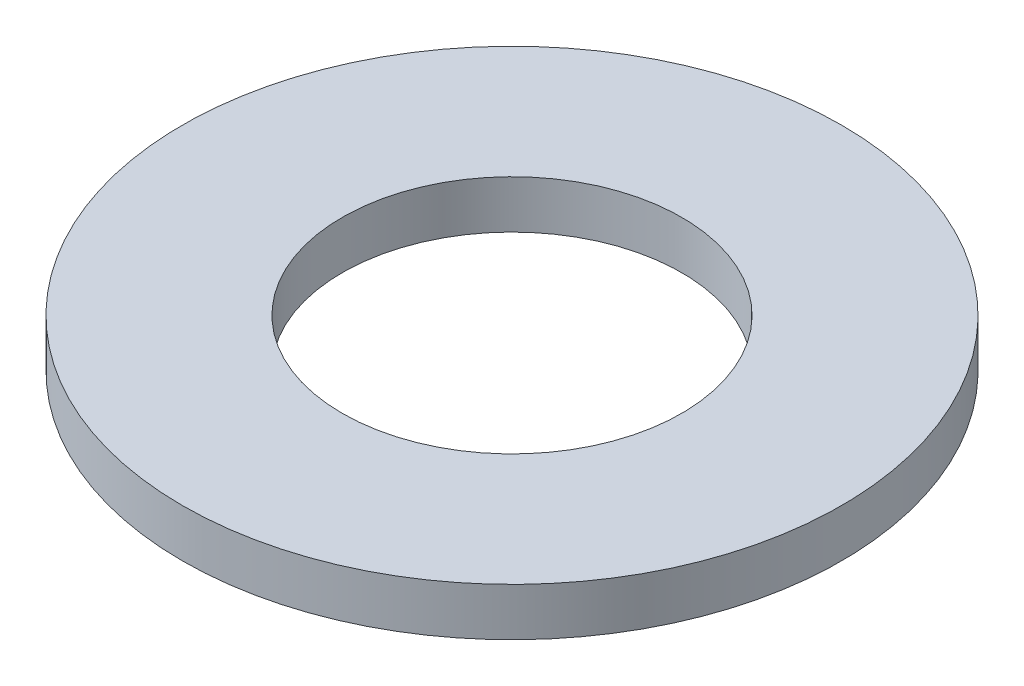
ISO-10303-21;
HEADER;
FILE_DESCRIPTION(('STEP AP214'),'2;1');
FILE_NAME('part.step','',(''),(''),'','','');
FILE_SCHEMA(('AUTOMOTIVE_DESIGN { 1 0 10303 214 1 1 1 1 }'));
ENDSEC;
DATA;
#1=APPLICATION_CONTEXT('core data for automotive mechanical design processes');
#2=APPLICATION_PROTOCOL_DEFINITION('international standard','automotive_design',2000,#1);
#3=PRODUCT_CONTEXT('',#1,'mechanical');
#4=PRODUCT('Part','Part','',(#3));
#5=PRODUCT_RELATED_PRODUCT_CATEGORY('part','',(#4));
#6=PRODUCT_DEFINITION_FORMATION('','',#4);
#7=PRODUCT_DEFINITION_CONTEXT('part definition',#1,'design');
#8=PRODUCT_DEFINITION('design','',#6,#7);
#9=PRODUCT_DEFINITION_SHAPE('','',#8);
#10=(LENGTH_UNIT() NAMED_UNIT(*) SI_UNIT(.MILLI.,.METRE.));
#11=(NAMED_UNIT(*) PLANE_ANGLE_UNIT() SI_UNIT($,.RADIAN.));
#12=(NAMED_UNIT(*) SI_UNIT($,.STERADIAN.) SOLID_ANGLE_UNIT());
#13=UNCERTAINTY_MEASURE_WITH_UNIT(LENGTH_MEASURE(1.E-05),#10,'distance_accuracy_value','');
#14=(GEOMETRIC_REPRESENTATION_CONTEXT(3) GLOBAL_UNCERTAINTY_ASSIGNED_CONTEXT((#13)) GLOBAL_UNIT_ASSIGNED_CONTEXT((#10,
#11,#12)) REPRESENTATION_CONTEXT('',''));
#15=CARTESIAN_POINT('',(0.,0.,0.));
#16=DIRECTION('',(0.,0.,1.));
#17=DIRECTION('',(1.,0.,0.));
#18=AXIS2_PLACEMENT_3D('',#15,#16,#17);
#19=CARTESIAN_POINT('',(0.,12.,0.));
#20=DIRECTION('',(0.,-1.,0.));
#21=DIRECTION('',(0.,0.,-1.));
#22=AXIS2_PLACEMENT_3D('',#19,#20,#21);
#23=CYLINDRICAL_SURFACE('',#22,82.5);
#24=CARTESIAN_POINT('',(0.,12.,0.));
#25=DIRECTION('',(0.,1.,0.));
#26=DIRECTION('',(0.,0.,1.));
#27=AXIS2_PLACEMENT_3D('',#24,#25,#26);
#28=CIRCLE('',#27,82.5);
#29=CARTESIAN_POINT('',(0.,12.,82.5));
#30=VERTEX_POINT('',#29);
#31=EDGE_CURVE('E10',#30,#30,#28,.T.);
#32=ORIENTED_EDGE('',*,*,#31,.F.);
#33=EDGE_LOOP('',(#32));
#34=FACE_BOUND('',#33,.T.);
#35=CARTESIAN_POINT('',(0.,0.,0.));
#36=DIRECTION('',(0.,1.,0.));
#37=DIRECTION('',(0.,0.,1.));
#38=AXIS2_PLACEMENT_3D('',#35,#36,#37);
#39=CIRCLE('',#38,82.5);
#40=CARTESIAN_POINT('',(0.,0.,82.5));
#41=VERTEX_POINT('',#40);
#42=EDGE_CURVE('E37',#41,#41,#39,.T.);
#43=ORIENTED_EDGE('',*,*,#42,.T.);
#44=EDGE_LOOP('',(#43));
#45=FACE_BOUND('',#44,.T.);
#46=ADVANCED_FACE('F40',(#34,#45),#23,.T.);
#47=CARTESIAN_POINT('',(0.,12.,0.));
#48=DIRECTION('',(0.,1.,0.));
#49=DIRECTION('',(0.,0.,1.));
#50=AXIS2_PLACEMENT_3D('',#47,#48,#49);
#51=PLANE('',#50);
#52=CARTESIAN_POINT('',(0.,12.,0.));
#53=DIRECTION('',(0.,1.,0.));
#54=DIRECTION('',(0.,0.,1.));
#55=AXIS2_PLACEMENT_3D('',#52,#53,#54);
#56=CIRCLE('',#55,42.5);
#57=CARTESIAN_POINT('',(0.,12.,42.5));
#58=VERTEX_POINT('',#57);
#59=EDGE_CURVE('E50',#58,#58,#56,.T.);
#60=ORIENTED_EDGE('',*,*,#59,.F.);
#61=EDGE_LOOP('',(#60));
#62=FACE_BOUND('',#61,.T.);
#63=ORIENTED_EDGE('',*,*,#31,.T.);
#64=EDGE_LOOP('',(#63));
#65=FACE_BOUND('',#64,.T.);
#66=ADVANCED_FACE('F59',(#62,#65),#51,.T.);
#67=CARTESIAN_POINT('',(0.,0.,0.));
#68=DIRECTION('',(0.,1.,0.));
#69=DIRECTION('',(0.,0.,1.));
#70=AXIS2_PLACEMENT_3D('',#67,#68,#69);
#71=PLANE('',#70);
#72=CARTESIAN_POINT('',(0.,0.,0.));
#73=DIRECTION('',(0.,1.,0.));
#74=DIRECTION('',(0.,0.,1.));
#75=AXIS2_PLACEMENT_3D('',#72,#73,#74);
#76=CIRCLE('',#75,42.5);
#77=CARTESIAN_POINT('',(0.,0.,42.5));
#78=VERTEX_POINT('',#77);
#79=EDGE_CURVE('E47',#78,#78,#76,.T.);
#80=ORIENTED_EDGE('',*,*,#79,.T.);
#81=EDGE_LOOP('',(#80));
#82=FACE_BOUND('',#81,.T.);
#83=ORIENTED_EDGE('',*,*,#42,.F.);
#84=EDGE_LOOP('',(#83));
#85=FACE_BOUND('',#84,.T.);
#86=ADVANCED_FACE('F58',(#82,#85),#71,.F.);
#87=CARTESIAN_POINT('',(0.,12.,0.));
#88=DIRECTION('',(0.,-1.,0.));
#89=DIRECTION('',(0.,0.,-1.));
#90=AXIS2_PLACEMENT_3D('',#87,#88,#89);
#91=CYLINDRICAL_SURFACE('',#90,42.5);
#92=ORIENTED_EDGE('',*,*,#59,.T.);
#93=EDGE_LOOP('',(#92));
#94=FACE_BOUND('',#93,.T.);
#95=ORIENTED_EDGE('',*,*,#79,.F.);
#96=EDGE_LOOP('',(#95));
#97=FACE_BOUND('',#96,.T.);
#98=ADVANCED_FACE('F54',(#94,#97),#91,.F.);
#99=CLOSED_SHELL('',(#46,#66,#86,#98));
#100=MANIFOLD_SOLID_BREP('B2',#99);
#101=ADVANCED_BREP_SHAPE_REPRESENTATION('',(#18,#100),#14);
#102=SHAPE_DEFINITION_REPRESENTATION(#9,#101);
ENDSEC;
END-ISO-10303-21;
